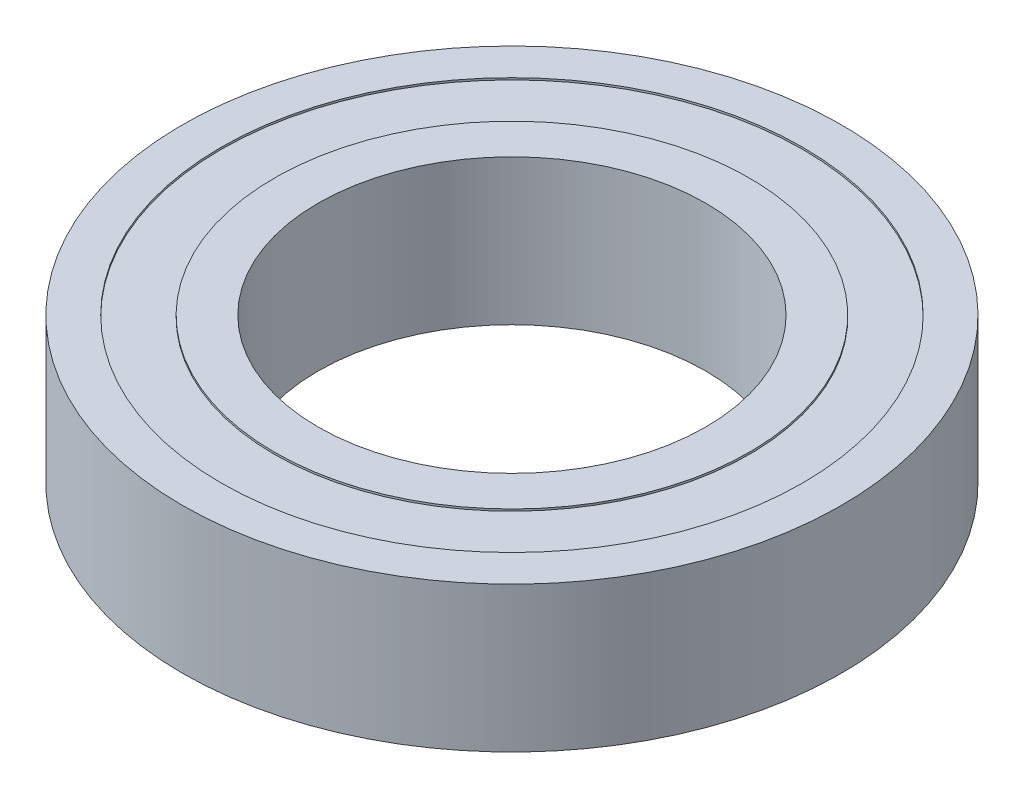
ISO-10303-21;
HEADER;
FILE_DESCRIPTION(('STEP AP214'),'2;1');
FILE_NAME('part.step','',(''),(''),'','','');
FILE_SCHEMA(('AUTOMOTIVE_DESIGN { 1 0 10303 214 1 1 1 1 }'));
ENDSEC;
DATA;
#1=APPLICATION_CONTEXT('core data for automotive mechanical design processes');
#2=APPLICATION_PROTOCOL_DEFINITION('international standard','automotive_design',2000,#1);
#3=PRODUCT_CONTEXT('',#1,'mechanical');
#4=PRODUCT('Part','Part','',(#3));
#5=PRODUCT_RELATED_PRODUCT_CATEGORY('part','',(#4));
#6=PRODUCT_DEFINITION_FORMATION('','',#4);
#7=PRODUCT_DEFINITION_CONTEXT('part definition',#1,'design');
#8=PRODUCT_DEFINITION('design','',#6,#7);
#9=PRODUCT_DEFINITION_SHAPE('','',#8);
#10=(LENGTH_UNIT() NAMED_UNIT(*) SI_UNIT(.MILLI.,.METRE.));
#11=(NAMED_UNIT(*) PLANE_ANGLE_UNIT() SI_UNIT($,.RADIAN.));
#12=(NAMED_UNIT(*) SI_UNIT($,.STERADIAN.) SOLID_ANGLE_UNIT());
#13=UNCERTAINTY_MEASURE_WITH_UNIT(LENGTH_MEASURE(1.E-05),#10,'distance_accuracy_value','');
#14=(GEOMETRIC_REPRESENTATION_CONTEXT(3) GLOBAL_UNCERTAINTY_ASSIGNED_CONTEXT((#13)) GLOBAL_UNIT_ASSIGNED_CONTEXT((#10,
#11,#12)) REPRESENTATION_CONTEXT('',''));
#15=CARTESIAN_POINT('',(0.,0.,0.));
#16=DIRECTION('',(0.,0.,1.));
#17=DIRECTION('',(1.,0.,0.));
#18=AXIS2_PLACEMENT_3D('',#15,#16,#17);
#19=CARTESIAN_POINT('',(0.,0.,0.));
#20=DIRECTION('',(0.,1.,0.));
#21=DIRECTION('',(0.,0.,1.));
#22=AXIS2_PLACEMENT_3D('',#19,#20,#21);
#23=PLANE('',#22);
#24=CARTESIAN_POINT('',(0.,0.,0.));
#25=DIRECTION('',(0.,1.,0.));
#26=DIRECTION('',(0.,0.,1.));
#27=AXIS2_PLACEMENT_3D('',#24,#25,#26);
#28=CIRCLE('',#27,20.);
#29=CARTESIAN_POINT('',(0.,0.,20.));
#30=VERTEX_POINT('',#29);
#31=EDGE_CURVE('E47',#30,#30,#28,.T.);
#32=ORIENTED_EDGE('',*,*,#31,.T.);
#33=EDGE_LOOP('',(#32));
#34=FACE_BOUND('',#33,.T.);
#35=CARTESIAN_POINT('',(0.,0.,0.));
#36=DIRECTION('',(0.,-1.,0.));
#37=DIRECTION('',(0.,0.,-1.));
#38=AXIS2_PLACEMENT_3D('',#35,#36,#37);
#39=CIRCLE('',#38,24.5);
#40=CARTESIAN_POINT('',(0.,0.,-24.5));
#41=VERTEX_POINT('',#40);
#42=EDGE_CURVE('E71',#41,#41,#39,.T.);
#43=ORIENTED_EDGE('',*,*,#42,.T.);
#44=EDGE_LOOP('',(#43));
#45=FACE_BOUND('',#44,.T.);
#46=ADVANCED_FACE('F34',(#34,#45),#23,.F.);
#47=CARTESIAN_POINT('',(0.,15.,0.));
#48=DIRECTION('',(0.,1.,0.));
#49=DIRECTION('',(0.,0.,1.));
#50=AXIS2_PLACEMENT_3D('',#47,#48,#49);
#51=PLANE('',#50);
#52=CARTESIAN_POINT('',(0.,15.,0.));
#53=DIRECTION('',(0.,1.,0.));
#54=DIRECTION('',(0.,0.,1.));
#55=AXIS2_PLACEMENT_3D('',#52,#53,#54);
#56=CIRCLE('',#55,20.);
#57=CARTESIAN_POINT('',(0.,15.,20.));
#58=VERTEX_POINT('',#57);
#59=EDGE_CURVE('E45',#58,#58,#56,.T.);
#60=ORIENTED_EDGE('',*,*,#59,.F.);
#61=EDGE_LOOP('',(#60));
#62=FACE_BOUND('',#61,.T.);
#63=CARTESIAN_POINT('',(0.,15.,0.));
#64=DIRECTION('',(0.,1.,0.));
#65=DIRECTION('',(0.,0.,1.));
#66=AXIS2_PLACEMENT_3D('',#63,#64,#65);
#67=CIRCLE('',#66,24.5);
#68=CARTESIAN_POINT('',(0.,15.,24.5));
#69=VERTEX_POINT('',#68);
#70=EDGE_CURVE('E59',#69,#69,#67,.T.);
#71=ORIENTED_EDGE('',*,*,#70,.T.);
#72=EDGE_LOOP('',(#71));
#73=FACE_BOUND('',#72,.T.);
#74=ADVANCED_FACE('F109',(#62,#73),#51,.T.);
#75=CARTESIAN_POINT('',(0.,15.,0.));
#76=DIRECTION('',(0.,1.,0.));
#77=DIRECTION('',(0.,0.,1.));
#78=AXIS2_PLACEMENT_3D('',#75,#76,#77);
#79=CIRCLE('',#78,30.);
#80=CARTESIAN_POINT('',(0.,15.,30.));
#81=VERTEX_POINT('',#80);
#82=EDGE_CURVE('E53',#81,#81,#79,.T.);
#83=ORIENTED_EDGE('',*,*,#82,.F.);
#84=EDGE_LOOP('',(#83));
#85=FACE_BOUND('',#84,.T.);
#86=CARTESIAN_POINT('',(0.,15.,0.));
#87=DIRECTION('',(0.,1.,0.));
#88=DIRECTION('',(0.,0.,1.));
#89=AXIS2_PLACEMENT_3D('',#86,#87,#88);
#90=CIRCLE('',#89,34.);
#91=CARTESIAN_POINT('',(0.,15.,34.));
#92=VERTEX_POINT('',#91);
#93=EDGE_CURVE('E10',#92,#92,#90,.T.);
#94=ORIENTED_EDGE('',*,*,#93,.T.);
#95=EDGE_LOOP('',(#94));
#96=FACE_BOUND('',#95,.T.);
#97=ADVANCED_FACE('F96',(#85,#96),#51,.T.);
#98=CARTESIAN_POINT('',(0.,0.,0.));
#99=DIRECTION('',(0.,-1.,0.));
#100=DIRECTION('',(0.,0.,-1.));
#101=AXIS2_PLACEMENT_3D('',#98,#99,#100);
#102=CIRCLE('',#101,30.);
#103=CARTESIAN_POINT('',(0.,0.,-30.));
#104=VERTEX_POINT('',#103);
#105=EDGE_CURVE('E65',#104,#104,#102,.T.);
#106=ORIENTED_EDGE('',*,*,#105,.F.);
#107=EDGE_LOOP('',(#106));
#108=FACE_BOUND('',#107,.T.);
#109=CARTESIAN_POINT('',(0.,0.,0.));
#110=DIRECTION('',(0.,1.,0.));
#111=DIRECTION('',(0.,0.,1.));
#112=AXIS2_PLACEMENT_3D('',#109,#110,#111);
#113=CIRCLE('',#112,34.);
#114=CARTESIAN_POINT('',(0.,0.,34.));
#115=VERTEX_POINT('',#114);
#116=EDGE_CURVE('E38',#115,#115,#113,.T.);
#117=ORIENTED_EDGE('',*,*,#116,.F.);
#118=EDGE_LOOP('',(#117));
#119=FACE_BOUND('',#118,.T.);
#120=ADVANCED_FACE('F93',(#108,#119),#23,.F.);
#121=CARTESIAN_POINT('',(0.,15.,0.));
#122=DIRECTION('',(0.,-1.,0.));
#123=DIRECTION('',(0.,0.,-1.));
#124=AXIS2_PLACEMENT_3D('',#121,#122,#123);
#125=CYLINDRICAL_SURFACE('',#124,34.);
#126=ORIENTED_EDGE('',*,*,#93,.F.);
#127=EDGE_LOOP('',(#126));
#128=FACE_BOUND('',#127,.T.);
#129=ORIENTED_EDGE('',*,*,#116,.T.);
#130=EDGE_LOOP('',(#129));
#131=FACE_BOUND('',#130,.T.);
#132=ADVANCED_FACE('F36',(#128,#131),#125,.T.);
#133=CARTESIAN_POINT('',(0.,15.,0.));
#134=DIRECTION('',(0.,-1.,0.));
#135=DIRECTION('',(0.,0.,-1.));
#136=AXIS2_PLACEMENT_3D('',#133,#134,#135);
#137=CYLINDRICAL_SURFACE('',#136,20.);
#138=ORIENTED_EDGE('',*,*,#59,.T.);
#139=EDGE_LOOP('',(#138));
#140=FACE_BOUND('',#139,.T.);
#141=ORIENTED_EDGE('',*,*,#31,.F.);
#142=EDGE_LOOP('',(#141));
#143=FACE_BOUND('',#142,.T.);
#144=ADVANCED_FACE('F100',(#140,#143),#137,.F.);
#145=CARTESIAN_POINT('',(0.,14.8,0.));
#146=DIRECTION('',(0.,1.,0.));
#147=DIRECTION('',(0.,0.,1.));
#148=AXIS2_PLACEMENT_3D('',#145,#146,#147);
#149=CYLINDRICAL_SURFACE('',#148,30.);
#150=CARTESIAN_POINT('',(0.,14.8,0.));
#151=DIRECTION('',(0.,1.,0.));
#152=DIRECTION('',(0.,0.,1.));
#153=AXIS2_PLACEMENT_3D('',#150,#151,#152);
#154=CIRCLE('',#153,30.);
#155=CARTESIAN_POINT('',(0.,14.8,30.));
#156=VERTEX_POINT('',#155);
#157=EDGE_CURVE('E50',#156,#156,#154,.T.);
#158=ORIENTED_EDGE('',*,*,#157,.F.);
#159=EDGE_LOOP('',(#158));
#160=FACE_BOUND('',#159,.T.);
#161=ORIENTED_EDGE('',*,*,#82,.T.);
#162=EDGE_LOOP('',(#161));
#163=FACE_BOUND('',#162,.T.);
#164=ADVANCED_FACE('F105',(#160,#163),#149,.F.);
#165=CARTESIAN_POINT('',(0.,14.8,0.));
#166=DIRECTION('',(0.,1.,0.));
#167=DIRECTION('',(0.,0.,1.));
#168=AXIS2_PLACEMENT_3D('',#165,#166,#167);
#169=PLANE('',#168);
#170=CARTESIAN_POINT('',(0.,14.8,0.));
#171=DIRECTION('',(0.,1.,0.));
#172=DIRECTION('',(0.,0.,1.));
#173=AXIS2_PLACEMENT_3D('',#170,#171,#172);
#174=CIRCLE('',#173,24.5);
#175=CARTESIAN_POINT('',(0.,14.8,24.5));
#176=VERTEX_POINT('',#175);
#177=EDGE_CURVE('E56',#176,#176,#174,.T.);
#178=ORIENTED_EDGE('',*,*,#177,.F.);
#179=EDGE_LOOP('',(#178));
#180=FACE_BOUND('',#179,.T.);
#181=ORIENTED_EDGE('',*,*,#157,.T.);
#182=EDGE_LOOP('',(#181));
#183=FACE_BOUND('',#182,.T.);
#184=ADVANCED_FACE('F122',(#180,#183),#169,.T.);
#185=CARTESIAN_POINT('',(0.,14.8,0.));
#186=DIRECTION('',(0.,1.,0.));
#187=DIRECTION('',(0.,0.,1.));
#188=AXIS2_PLACEMENT_3D('',#185,#186,#187);
#189=CYLINDRICAL_SURFACE('',#188,24.5);
#190=ORIENTED_EDGE('',*,*,#177,.T.);
#191=EDGE_LOOP('',(#190));
#192=FACE_BOUND('',#191,.T.);
#193=ORIENTED_EDGE('',*,*,#70,.F.);
#194=EDGE_LOOP('',(#193));
#195=FACE_BOUND('',#194,.T.);
#196=ADVANCED_FACE('F89',(#192,#195),#189,.T.);
#197=CARTESIAN_POINT('',(0.,0.2,0.));
#198=DIRECTION('',(0.,-1.,0.));
#199=DIRECTION('',(0.,0.,-1.));
#200=AXIS2_PLACEMENT_3D('',#197,#198,#199);
#201=CYLINDRICAL_SURFACE('',#200,30.);
#202=CARTESIAN_POINT('',(0.,0.2,0.));
#203=DIRECTION('',(0.,-1.,0.));
#204=DIRECTION('',(0.,0.,-1.));
#205=AXIS2_PLACEMENT_3D('',#202,#203,#204);
#206=CIRCLE('',#205,30.);
#207=CARTESIAN_POINT('',(0.,0.2,-30.));
#208=VERTEX_POINT('',#207);
#209=EDGE_CURVE('E62',#208,#208,#206,.T.);
#210=ORIENTED_EDGE('',*,*,#209,.F.);
#211=EDGE_LOOP('',(#210));
#212=FACE_BOUND('',#211,.T.);
#213=ORIENTED_EDGE('',*,*,#105,.T.);
#214=EDGE_LOOP('',(#213));
#215=FACE_BOUND('',#214,.T.);
#216=ADVANCED_FACE('F83',(#212,#215),#201,.F.);
#217=CARTESIAN_POINT('',(0.,0.2,0.));
#218=DIRECTION('',(0.,-1.,0.));
#219=DIRECTION('',(0.,0.,-1.));
#220=AXIS2_PLACEMENT_3D('',#217,#218,#219);
#221=PLANE('',#220);
#222=CARTESIAN_POINT('',(0.,0.2,0.));
#223=DIRECTION('',(0.,-1.,0.));
#224=DIRECTION('',(0.,0.,-1.));
#225=AXIS2_PLACEMENT_3D('',#222,#223,#224);
#226=CIRCLE('',#225,24.5);
#227=CARTESIAN_POINT('',(0.,0.2,-24.5));
#228=VERTEX_POINT('',#227);
#229=EDGE_CURVE('E68',#228,#228,#226,.T.);
#230=ORIENTED_EDGE('',*,*,#229,.F.);
#231=EDGE_LOOP('',(#230));
#232=FACE_BOUND('',#231,.T.);
#233=ORIENTED_EDGE('',*,*,#209,.T.);
#234=EDGE_LOOP('',(#233));
#235=FACE_BOUND('',#234,.T.);
#236=ADVANCED_FACE('F80',(#232,#235),#221,.T.);
#237=CARTESIAN_POINT('',(0.,0.2,0.));
#238=DIRECTION('',(0.,-1.,0.));
#239=DIRECTION('',(0.,0.,-1.));
#240=AXIS2_PLACEMENT_3D('',#237,#238,#239);
#241=CYLINDRICAL_SURFACE('',#240,24.5);
#242=ORIENTED_EDGE('',*,*,#229,.T.);
#243=EDGE_LOOP('',(#242));
#244=FACE_BOUND('',#243,.T.);
#245=ORIENTED_EDGE('',*,*,#42,.F.);
#246=EDGE_LOOP('',(#245));
#247=FACE_BOUND('',#246,.T.);
#248=ADVANCED_FACE('F77',(#244,#247),#241,.T.);
#249=CLOSED_SHELL('',(#46,#74,#97,#120,#132,#144,#164,#184,#196,#216,#236,#248));
#250=MANIFOLD_SOLID_BREP('B2',#249);
#251=ADVANCED_BREP_SHAPE_REPRESENTATION('',(#18,#250),#14);
#252=SHAPE_DEFINITION_REPRESENTATION(#9,#251);
ENDSEC;
END-ISO-10303-21;
